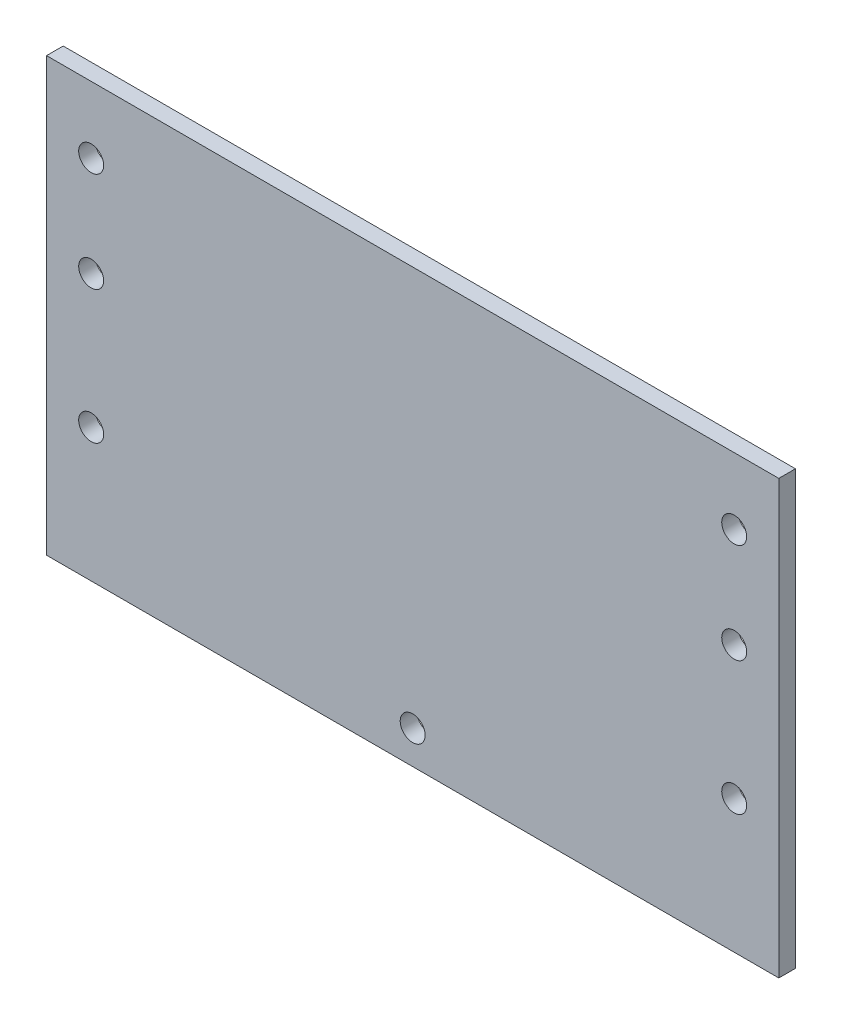
ISO-10303-21;
HEADER;
FILE_DESCRIPTION(('STEP AP214'),'2;1');
FILE_NAME('part.step','',(''),(''),'','','');
FILE_SCHEMA(('AUTOMOTIVE_DESIGN { 1 0 10303 214 1 1 1 1 }'));
ENDSEC;
DATA;
#1=APPLICATION_CONTEXT('core data for automotive mechanical design processes');
#2=APPLICATION_PROTOCOL_DEFINITION('international standard','automotive_design',2000,#1);
#3=PRODUCT_CONTEXT('',#1,'mechanical');
#4=PRODUCT('Part','Part','',(#3));
#5=PRODUCT_RELATED_PRODUCT_CATEGORY('part','',(#4));
#6=PRODUCT_DEFINITION_FORMATION('','',#4);
#7=PRODUCT_DEFINITION_CONTEXT('part definition',#1,'design');
#8=PRODUCT_DEFINITION('design','',#6,#7);
#9=PRODUCT_DEFINITION_SHAPE('','',#8);
#10=(LENGTH_UNIT() NAMED_UNIT(*) SI_UNIT(.MILLI.,.METRE.));
#11=(NAMED_UNIT(*) PLANE_ANGLE_UNIT() SI_UNIT($,.RADIAN.));
#12=(NAMED_UNIT(*) SI_UNIT($,.STERADIAN.) SOLID_ANGLE_UNIT());
#13=UNCERTAINTY_MEASURE_WITH_UNIT(LENGTH_MEASURE(1.E-05),#10,'distance_accuracy_value','');
#14=(GEOMETRIC_REPRESENTATION_CONTEXT(3) GLOBAL_UNCERTAINTY_ASSIGNED_CONTEXT((#13)) GLOBAL_UNIT_ASSIGNED_CONTEXT((#10,
#11,#12)) REPRESENTATION_CONTEXT('',''));
#15=CARTESIAN_POINT('',(0.,0.,0.));
#16=DIRECTION('',(0.,0.,1.));
#17=DIRECTION('',(1.,0.,0.));
#18=AXIS2_PLACEMENT_3D('',#15,#16,#17);
#19=CARTESIAN_POINT('',(0.,0.,12.7));
#20=DIRECTION('',(1.,0.,0.));
#21=DIRECTION('',(0.,1.,0.));
#22=AXIS2_PLACEMENT_3D('',#19,#20,#21);
#23=PLANE('',#22);
#24=DIRECTION('',(0.,-1.,0.));
#25=VECTOR('',#24,1.);
#26=CARTESIAN_POINT('',(0.,0.,0.));
#27=LINE('',#26,#25);
#28=CARTESIAN_POINT('',(0.,0.,0.));
#29=VERTEX_POINT('',#28);
#30=CARTESIAN_POINT('',(0.,-330.2,0.));
#31=VERTEX_POINT('',#30);
#32=EDGE_CURVE('E98',#29,#31,#27,.T.);
#33=ORIENTED_EDGE('',*,*,#32,.T.);
#34=DIRECTION('',(0.,0.,-1.));
#35=VECTOR('',#34,1.);
#36=CARTESIAN_POINT('',(0.,-330.2,12.7));
#37=LINE('',#36,#35);
#38=CARTESIAN_POINT('',(0.,-330.2,12.7));
#39=VERTEX_POINT('',#38);
#40=EDGE_CURVE('E11',#39,#31,#37,.T.);
#41=ORIENTED_EDGE('',*,*,#40,.F.);
#42=DIRECTION('',(0.,-1.,0.));
#43=VECTOR('',#42,1.);
#44=CARTESIAN_POINT('',(0.,0.,12.7));
#45=LINE('',#44,#43);
#46=CARTESIAN_POINT('',(0.,0.,12.7));
#47=VERTEX_POINT('',#46);
#48=EDGE_CURVE('E86',#47,#39,#45,.T.);
#49=ORIENTED_EDGE('',*,*,#48,.F.);
#50=DIRECTION('',(0.,0.,-1.));
#51=VECTOR('',#50,1.);
#52=CARTESIAN_POINT('',(0.,0.,12.7));
#53=LINE('',#52,#51);
#54=EDGE_CURVE('E94',#47,#29,#53,.T.);
#55=ORIENTED_EDGE('',*,*,#54,.T.);
#56=EDGE_LOOP('',(#33,#41,#49,#55));
#57=FACE_BOUND('',#56,.T.);
#58=ADVANCED_FACE('F35',(#57),#23,.F.);
#59=CARTESIAN_POINT('',(0.,-330.2,12.7));
#60=DIRECTION('',(0.,1.,0.));
#61=DIRECTION('',(0.,0.,1.));
#62=AXIS2_PLACEMENT_3D('',#59,#60,#61);
#63=PLANE('',#62);
#64=DIRECTION('',(1.,0.,0.));
#65=VECTOR('',#64,1.);
#66=CARTESIAN_POINT('',(0.,-330.2,0.));
#67=LINE('',#66,#65);
#68=CARTESIAN_POINT('',(558.8,-330.2,0.));
#69=VERTEX_POINT('',#68);
#70=EDGE_CURVE('E90',#31,#69,#67,.T.);
#71=ORIENTED_EDGE('',*,*,#70,.T.);
#72=DIRECTION('',(0.,0.,-1.));
#73=VECTOR('',#72,1.);
#74=CARTESIAN_POINT('',(558.8,-330.2,12.7));
#75=LINE('',#74,#73);
#76=CARTESIAN_POINT('',(558.8,-330.2,12.7));
#77=VERTEX_POINT('',#76);
#78=EDGE_CURVE('E43',#77,#69,#75,.T.);
#79=ORIENTED_EDGE('',*,*,#78,.F.);
#80=DIRECTION('',(1.,0.,0.));
#81=VECTOR('',#80,1.);
#82=CARTESIAN_POINT('',(0.,-330.2,12.7));
#83=LINE('',#82,#81);
#84=EDGE_CURVE('E81',#39,#77,#83,.T.);
#85=ORIENTED_EDGE('',*,*,#84,.F.);
#86=ORIENTED_EDGE('',*,*,#40,.T.);
#87=EDGE_LOOP('',(#71,#79,#85,#86));
#88=FACE_BOUND('',#87,.T.);
#89=ADVANCED_FACE('F89',(#88),#63,.F.);
#90=CARTESIAN_POINT('',(558.8,0.,12.7));
#91=DIRECTION('',(-1.,0.,0.));
#92=DIRECTION('',(0.,0.,1.));
#93=AXIS2_PLACEMENT_3D('',#90,#91,#92);
#94=PLANE('',#93);
#95=DIRECTION('',(0.,1.,0.));
#96=VECTOR('',#95,1.);
#97=CARTESIAN_POINT('',(558.8,0.,0.));
#98=LINE('',#97,#96);
#99=CARTESIAN_POINT('',(558.8,0.,0.));
#100=VERTEX_POINT('',#99);
#101=EDGE_CURVE('E68',#69,#100,#98,.T.);
#102=ORIENTED_EDGE('',*,*,#101,.T.);
#103=DIRECTION('',(0.,0.,-1.));
#104=VECTOR('',#103,1.);
#105=CARTESIAN_POINT('',(558.8,0.,12.7));
#106=LINE('',#105,#104);
#107=CARTESIAN_POINT('',(558.8,0.,12.7));
#108=VERTEX_POINT('',#107);
#109=EDGE_CURVE('E91',#108,#100,#106,.T.);
#110=ORIENTED_EDGE('',*,*,#109,.F.);
#111=DIRECTION('',(0.,1.,0.));
#112=VECTOR('',#111,1.);
#113=CARTESIAN_POINT('',(558.8,0.,12.7));
#114=LINE('',#113,#112);
#115=EDGE_CURVE('E84',#77,#108,#114,.T.);
#116=ORIENTED_EDGE('',*,*,#115,.F.);
#117=ORIENTED_EDGE('',*,*,#78,.T.);
#118=EDGE_LOOP('',(#102,#110,#116,#117));
#119=FACE_BOUND('',#118,.T.);
#120=ADVANCED_FACE('F92',(#119),#94,.F.);
#121=CARTESIAN_POINT('',(0.,0.,12.7));
#122=DIRECTION('',(0.,-1.,0.));
#123=DIRECTION('',(0.,0.,-1.));
#124=AXIS2_PLACEMENT_3D('',#121,#122,#123);
#125=PLANE('',#124);
#126=DIRECTION('',(-1.,0.,0.));
#127=VECTOR('',#126,1.);
#128=CARTESIAN_POINT('',(0.,0.,0.));
#129=LINE('',#128,#127);
#130=EDGE_CURVE('E74',#100,#29,#129,.T.);
#131=ORIENTED_EDGE('',*,*,#130,.T.);
#132=ORIENTED_EDGE('',*,*,#54,.F.);
#133=DIRECTION('',(-1.,0.,0.));
#134=VECTOR('',#133,1.);
#135=CARTESIAN_POINT('',(0.,0.,12.7));
#136=LINE('',#135,#134);
#137=EDGE_CURVE('E51',#108,#47,#136,.T.);
#138=ORIENTED_EDGE('',*,*,#137,.F.);
#139=ORIENTED_EDGE('',*,*,#109,.T.);
#140=EDGE_LOOP('',(#131,#132,#138,#139));
#141=FACE_BOUND('',#140,.T.);
#142=ADVANCED_FACE('F106',(#141),#125,.F.);
#143=CARTESIAN_POINT('',(0.,0.,12.7));
#144=DIRECTION('',(0.,0.,1.));
#145=DIRECTION('',(1.,0.,0.));
#146=AXIS2_PLACEMENT_3D('',#143,#144,#145);
#147=PLANE('',#146);
#148=CARTESIAN_POINT('',(34.0360000000001,-50.7999999999999,12.7));
#149=DIRECTION('',(0.,0.,-1.));
#150=DIRECTION('',(1.,0.,0.));
#151=AXIS2_PLACEMENT_3D('',#148,#149,#150);
#152=CIRCLE('',#151,9.52500000000002);
#153=CARTESIAN_POINT('',(43.5610000000001,-50.7999999999999,12.7));
#154=VERTEX_POINT('',#153);
#155=EDGE_CURVE('E145',#154,#154,#152,.T.);
#156=ORIENTED_EDGE('',*,*,#155,.T.);
#157=EDGE_LOOP('',(#156));
#158=FACE_BOUND('',#157,.T.);
#159=CARTESIAN_POINT('',(34.036,-127.,12.7));
#160=DIRECTION('',(0.,0.,-1.));
#161=DIRECTION('',(1.,0.,0.));
#162=AXIS2_PLACEMENT_3D('',#159,#160,#161);
#163=CIRCLE('',#162,9.52500000000004);
#164=CARTESIAN_POINT('',(43.5610000000001,-127.,12.7));
#165=VERTEX_POINT('',#164);
#166=EDGE_CURVE('E139',#165,#165,#163,.T.);
#167=ORIENTED_EDGE('',*,*,#166,.T.);
#168=EDGE_LOOP('',(#167));
#169=FACE_BOUND('',#168,.T.);
#170=CARTESIAN_POINT('',(34.036,-228.6,12.7));
#171=DIRECTION('',(0.,0.,-1.));
#172=DIRECTION('',(1.,0.,0.));
#173=AXIS2_PLACEMENT_3D('',#170,#171,#172);
#174=CIRCLE('',#173,9.52500000000004);
#175=CARTESIAN_POINT('',(43.5610000000001,-228.6,12.7));
#176=VERTEX_POINT('',#175);
#177=EDGE_CURVE('E133',#176,#176,#174,.T.);
#178=ORIENTED_EDGE('',*,*,#177,.T.);
#179=EDGE_LOOP('',(#178));
#180=FACE_BOUND('',#179,.T.);
#181=CARTESIAN_POINT('',(524.764,-50.8,12.7));
#182=DIRECTION('',(0.,0.,-1.));
#183=DIRECTION('',(-1.,0.,0.));
#184=AXIS2_PLACEMENT_3D('',#181,#182,#183);
#185=CIRCLE('',#184,9.52500000000002);
#186=CARTESIAN_POINT('',(515.239,-50.8,12.7));
#187=VERTEX_POINT('',#186);
#188=EDGE_CURVE('E127',#187,#187,#185,.T.);
#189=ORIENTED_EDGE('',*,*,#188,.T.);
#190=EDGE_LOOP('',(#189));
#191=FACE_BOUND('',#190,.T.);
#192=CARTESIAN_POINT('',(524.764,-127.,12.7));
#193=DIRECTION('',(0.,0.,-1.));
#194=DIRECTION('',(-1.,0.,0.));
#195=AXIS2_PLACEMENT_3D('',#192,#193,#194);
#196=CIRCLE('',#195,9.52500000000002);
#197=CARTESIAN_POINT('',(515.239,-127.,12.7));
#198=VERTEX_POINT('',#197);
#199=EDGE_CURVE('E121',#198,#198,#196,.T.);
#200=ORIENTED_EDGE('',*,*,#199,.T.);
#201=EDGE_LOOP('',(#200));
#202=FACE_BOUND('',#201,.T.);
#203=CARTESIAN_POINT('',(524.764,-228.6,12.7));
#204=DIRECTION('',(0.,0.,-1.));
#205=DIRECTION('',(-1.,0.,0.));
#206=AXIS2_PLACEMENT_3D('',#203,#204,#205);
#207=CIRCLE('',#206,9.52500000000002);
#208=CARTESIAN_POINT('',(515.239,-228.6,12.7));
#209=VERTEX_POINT('',#208);
#210=EDGE_CURVE('E115',#209,#209,#207,.T.);
#211=ORIENTED_EDGE('',*,*,#210,.T.);
#212=EDGE_LOOP('',(#211));
#213=FACE_BOUND('',#212,.T.);
#214=CARTESIAN_POINT('',(279.4,-304.8,12.7));
#215=DIRECTION('',(0.,0.,-1.));
#216=DIRECTION('',(-1.,0.,0.));
#217=AXIS2_PLACEMENT_3D('',#214,#215,#216);
#218=CIRCLE('',#217,9.52500000000002);
#219=CARTESIAN_POINT('',(269.875,-304.8,12.7));
#220=VERTEX_POINT('',#219);
#221=EDGE_CURVE('E101',#220,#220,#218,.T.);
#222=ORIENTED_EDGE('',*,*,#221,.T.);
#223=EDGE_LOOP('',(#222));
#224=FACE_BOUND('',#223,.T.);
#225=ORIENTED_EDGE('',*,*,#48,.T.);
#226=ORIENTED_EDGE('',*,*,#84,.T.);
#227=ORIENTED_EDGE('',*,*,#115,.T.);
#228=ORIENTED_EDGE('',*,*,#137,.T.);
#229=EDGE_LOOP('',(#225,#226,#227,#228));
#230=FACE_BOUND('',#229,.T.);
#231=ADVANCED_FACE('F82',(#158,#169,#180,#191,#202,#213,#224,#230),#147,.T.);
#232=CARTESIAN_POINT('',(0.,0.,0.));
#233=DIRECTION('',(0.,0.,1.));
#234=DIRECTION('',(1.,0.,0.));
#235=AXIS2_PLACEMENT_3D('',#232,#233,#234);
#236=PLANE('',#235);
#237=CARTESIAN_POINT('',(34.0360000000001,-50.7999999999999,0.));
#238=DIRECTION('',(0.,0.,-1.));
#239=DIRECTION('',(1.,0.,0.));
#240=AXIS2_PLACEMENT_3D('',#237,#238,#239);
#241=CIRCLE('',#240,9.52500000000002);
#242=CARTESIAN_POINT('',(43.5610000000001,-50.7999999999999,0.));
#243=VERTEX_POINT('',#242);
#244=EDGE_CURVE('E148',#243,#243,#241,.T.);
#245=ORIENTED_EDGE('',*,*,#244,.F.);
#246=EDGE_LOOP('',(#245));
#247=FACE_BOUND('',#246,.T.);
#248=CARTESIAN_POINT('',(34.036,-127.,0.));
#249=DIRECTION('',(0.,0.,-1.));
#250=DIRECTION('',(1.,0.,0.));
#251=AXIS2_PLACEMENT_3D('',#248,#249,#250);
#252=CIRCLE('',#251,9.52500000000004);
#253=CARTESIAN_POINT('',(43.5610000000001,-127.,0.));
#254=VERTEX_POINT('',#253);
#255=EDGE_CURVE('E142',#254,#254,#252,.T.);
#256=ORIENTED_EDGE('',*,*,#255,.F.);
#257=EDGE_LOOP('',(#256));
#258=FACE_BOUND('',#257,.T.);
#259=CARTESIAN_POINT('',(34.036,-228.6,0.));
#260=DIRECTION('',(0.,0.,-1.));
#261=DIRECTION('',(1.,0.,0.));
#262=AXIS2_PLACEMENT_3D('',#259,#260,#261);
#263=CIRCLE('',#262,9.52500000000004);
#264=CARTESIAN_POINT('',(43.5610000000001,-228.6,0.));
#265=VERTEX_POINT('',#264);
#266=EDGE_CURVE('E136',#265,#265,#263,.T.);
#267=ORIENTED_EDGE('',*,*,#266,.F.);
#268=EDGE_LOOP('',(#267));
#269=FACE_BOUND('',#268,.T.);
#270=CARTESIAN_POINT('',(524.764,-50.8,0.));
#271=DIRECTION('',(0.,0.,-1.));
#272=DIRECTION('',(-1.,0.,0.));
#273=AXIS2_PLACEMENT_3D('',#270,#271,#272);
#274=CIRCLE('',#273,9.52500000000002);
#275=CARTESIAN_POINT('',(515.239,-50.8,0.));
#276=VERTEX_POINT('',#275);
#277=EDGE_CURVE('E130',#276,#276,#274,.T.);
#278=ORIENTED_EDGE('',*,*,#277,.F.);
#279=EDGE_LOOP('',(#278));
#280=FACE_BOUND('',#279,.T.);
#281=CARTESIAN_POINT('',(524.764,-127.,0.));
#282=DIRECTION('',(0.,0.,-1.));
#283=DIRECTION('',(-1.,0.,0.));
#284=AXIS2_PLACEMENT_3D('',#281,#282,#283);
#285=CIRCLE('',#284,9.52500000000002);
#286=CARTESIAN_POINT('',(515.239,-127.,0.));
#287=VERTEX_POINT('',#286);
#288=EDGE_CURVE('E124',#287,#287,#285,.T.);
#289=ORIENTED_EDGE('',*,*,#288,.F.);
#290=EDGE_LOOP('',(#289));
#291=FACE_BOUND('',#290,.T.);
#292=CARTESIAN_POINT('',(524.764,-228.6,0.));
#293=DIRECTION('',(0.,0.,-1.));
#294=DIRECTION('',(-1.,0.,0.));
#295=AXIS2_PLACEMENT_3D('',#292,#293,#294);
#296=CIRCLE('',#295,9.52500000000002);
#297=CARTESIAN_POINT('',(515.239,-228.6,0.));
#298=VERTEX_POINT('',#297);
#299=EDGE_CURVE('E118',#298,#298,#296,.T.);
#300=ORIENTED_EDGE('',*,*,#299,.F.);
#301=EDGE_LOOP('',(#300));
#302=FACE_BOUND('',#301,.T.);
#303=CARTESIAN_POINT('',(279.4,-304.8,0.));
#304=DIRECTION('',(0.,0.,-1.));
#305=DIRECTION('',(-1.,0.,0.));
#306=AXIS2_PLACEMENT_3D('',#303,#304,#305);
#307=CIRCLE('',#306,9.52500000000002);
#308=CARTESIAN_POINT('',(269.875,-304.8,0.));
#309=VERTEX_POINT('',#308);
#310=EDGE_CURVE('E112',#309,#309,#307,.T.);
#311=ORIENTED_EDGE('',*,*,#310,.F.);
#312=EDGE_LOOP('',(#311));
#313=FACE_BOUND('',#312,.T.);
#314=ORIENTED_EDGE('',*,*,#32,.F.);
#315=ORIENTED_EDGE('',*,*,#130,.F.);
#316=ORIENTED_EDGE('',*,*,#101,.F.);
#317=ORIENTED_EDGE('',*,*,#70,.F.);
#318=EDGE_LOOP('',(#314,#315,#316,#317));
#319=FACE_BOUND('',#318,.T.);
#320=ADVANCED_FACE('F109',(#247,#258,#269,#280,#291,#302,#313,#319),#236,.F.);
#321=CARTESIAN_POINT('',(279.4,-304.8,12.7));
#322=DIRECTION('',(0.,0.,-1.));
#323=DIRECTION('',(-1.,0.,0.));
#324=AXIS2_PLACEMENT_3D('',#321,#322,#323);
#325=CYLINDRICAL_SURFACE('',#324,9.52500000000002);
#326=ORIENTED_EDGE('',*,*,#221,.F.);
#327=EDGE_LOOP('',(#326));
#328=FACE_BOUND('',#327,.T.);
#329=ORIENTED_EDGE('',*,*,#310,.T.);
#330=EDGE_LOOP('',(#329));
#331=FACE_BOUND('',#330,.T.);
#332=ADVANCED_FACE('F165',(#328,#331),#325,.F.);
#333=CARTESIAN_POINT('',(524.764,-228.6,12.7));
#334=DIRECTION('',(0.,0.,-1.));
#335=DIRECTION('',(-1.,0.,0.));
#336=AXIS2_PLACEMENT_3D('',#333,#334,#335);
#337=CYLINDRICAL_SURFACE('',#336,9.52500000000002);
#338=ORIENTED_EDGE('',*,*,#210,.F.);
#339=EDGE_LOOP('',(#338));
#340=FACE_BOUND('',#339,.T.);
#341=ORIENTED_EDGE('',*,*,#299,.T.);
#342=EDGE_LOOP('',(#341));
#343=FACE_BOUND('',#342,.T.);
#344=ADVANCED_FACE('F180',(#340,#343),#337,.F.);
#345=CARTESIAN_POINT('',(524.764,-127.,12.7));
#346=DIRECTION('',(0.,0.,-1.));
#347=DIRECTION('',(-1.,0.,0.));
#348=AXIS2_PLACEMENT_3D('',#345,#346,#347);
#349=CYLINDRICAL_SURFACE('',#348,9.52500000000002);
#350=ORIENTED_EDGE('',*,*,#199,.F.);
#351=EDGE_LOOP('',(#350));
#352=FACE_BOUND('',#351,.T.);
#353=ORIENTED_EDGE('',*,*,#288,.T.);
#354=EDGE_LOOP('',(#353));
#355=FACE_BOUND('',#354,.T.);
#356=ADVANCED_FACE('F186',(#352,#355),#349,.F.);
#357=CARTESIAN_POINT('',(524.764,-50.8,12.7));
#358=DIRECTION('',(0.,0.,-1.));
#359=DIRECTION('',(-1.,0.,0.));
#360=AXIS2_PLACEMENT_3D('',#357,#358,#359);
#361=CYLINDRICAL_SURFACE('',#360,9.52500000000002);
#362=ORIENTED_EDGE('',*,*,#188,.F.);
#363=EDGE_LOOP('',(#362));
#364=FACE_BOUND('',#363,.T.);
#365=ORIENTED_EDGE('',*,*,#277,.T.);
#366=EDGE_LOOP('',(#365));
#367=FACE_BOUND('',#366,.T.);
#368=ADVANCED_FACE('F229',(#364,#367),#361,.F.);
#369=CARTESIAN_POINT('',(34.036,-228.6,12.7));
#370=DIRECTION('',(0.,0.,-1.));
#371=DIRECTION('',(-1.,0.,0.));
#372=AXIS2_PLACEMENT_3D('',#369,#370,#371);
#373=CYLINDRICAL_SURFACE('',#372,9.52500000000004);
#374=ORIENTED_EDGE('',*,*,#177,.F.);
#375=EDGE_LOOP('',(#374));
#376=FACE_BOUND('',#375,.T.);
#377=ORIENTED_EDGE('',*,*,#266,.T.);
#378=EDGE_LOOP('',(#377));
#379=FACE_BOUND('',#378,.T.);
#380=ADVANCED_FACE('F239',(#376,#379),#373,.F.);
#381=CARTESIAN_POINT('',(34.036,-127.,12.7));
#382=DIRECTION('',(0.,0.,-1.));
#383=DIRECTION('',(-1.,0.,0.));
#384=AXIS2_PLACEMENT_3D('',#381,#382,#383);
#385=CYLINDRICAL_SURFACE('',#384,9.52500000000004);
#386=ORIENTED_EDGE('',*,*,#166,.F.);
#387=EDGE_LOOP('',(#386));
#388=FACE_BOUND('',#387,.T.);
#389=ORIENTED_EDGE('',*,*,#255,.T.);
#390=EDGE_LOOP('',(#389));
#391=FACE_BOUND('',#390,.T.);
#392=ADVANCED_FACE('F159',(#388,#391),#385,.F.);
#393=CARTESIAN_POINT('',(34.0360000000001,-50.7999999999999,12.7));
#394=DIRECTION('',(0.,0.,-1.));
#395=DIRECTION('',(-1.,0.,0.));
#396=AXIS2_PLACEMENT_3D('',#393,#394,#395);
#397=CYLINDRICAL_SURFACE('',#396,9.52500000000002);
#398=ORIENTED_EDGE('',*,*,#155,.F.);
#399=EDGE_LOOP('',(#398));
#400=FACE_BOUND('',#399,.T.);
#401=ORIENTED_EDGE('',*,*,#244,.T.);
#402=EDGE_LOOP('',(#401));
#403=FACE_BOUND('',#402,.T.);
#404=ADVANCED_FACE('F156',(#400,#403),#397,.F.);
#405=CLOSED_SHELL('',(#58,#89,#120,#142,#231,#320,#332,#344,#356,#368,#380,#392,#404));
#406=MANIFOLD_SOLID_BREP('B2',#405);
#407=ADVANCED_BREP_SHAPE_REPRESENTATION('',(#18,#406),#14);
#408=SHAPE_DEFINITION_REPRESENTATION(#9,#407);
ENDSEC;
END-ISO-10303-21;
